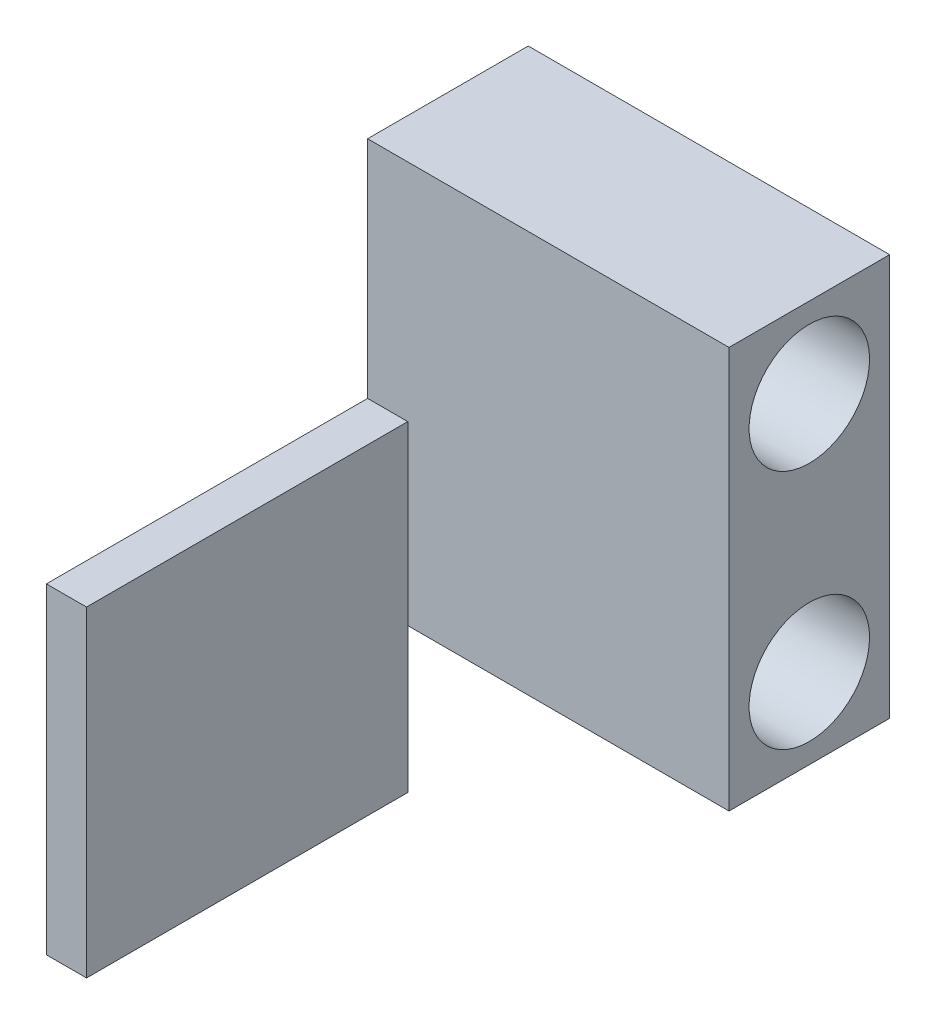
ISO-10303-21;
HEADER;
FILE_DESCRIPTION(('STEP AP214'),'2;1');
FILE_NAME('part.step','',(''),(''),'','','');
FILE_SCHEMA(('AUTOMOTIVE_DESIGN { 1 0 10303 214 1 1 1 1 }'));
ENDSEC;
DATA;
#1=APPLICATION_CONTEXT('core data for automotive mechanical design processes');
#2=APPLICATION_PROTOCOL_DEFINITION('international standard','automotive_design',2000,#1);
#3=PRODUCT_CONTEXT('',#1,'mechanical');
#4=PRODUCT('Part','Part','',(#3));
#5=PRODUCT_RELATED_PRODUCT_CATEGORY('part','',(#4));
#6=PRODUCT_DEFINITION_FORMATION('','',#4);
#7=PRODUCT_DEFINITION_CONTEXT('part definition',#1,'design');
#8=PRODUCT_DEFINITION('design','',#6,#7);
#9=PRODUCT_DEFINITION_SHAPE('','',#8);
#10=(LENGTH_UNIT() NAMED_UNIT(*) SI_UNIT(.MILLI.,.METRE.));
#11=(NAMED_UNIT(*) PLANE_ANGLE_UNIT() SI_UNIT($,.RADIAN.));
#12=(NAMED_UNIT(*) SI_UNIT($,.STERADIAN.) SOLID_ANGLE_UNIT());
#13=UNCERTAINTY_MEASURE_WITH_UNIT(LENGTH_MEASURE(1.E-05),#10,'distance_accuracy_value','');
#14=(GEOMETRIC_REPRESENTATION_CONTEXT(3) GLOBAL_UNCERTAINTY_ASSIGNED_CONTEXT((#13)) GLOBAL_UNIT_ASSIGNED_CONTEXT((#10,
#11,#12)) REPRESENTATION_CONTEXT('',''));
#15=CARTESIAN_POINT('',(0.,0.,0.));
#16=DIRECTION('',(0.,0.,1.));
#17=DIRECTION('',(1.,0.,0.));
#18=AXIS2_PLACEMENT_3D('',#15,#16,#17);
#19=CARTESIAN_POINT('',(22.5,25.,10.));
#20=DIRECTION('',(0.,0.,-1.));
#21=DIRECTION('',(-1.,0.,0.));
#22=AXIS2_PLACEMENT_3D('',#19,#20,#21);
#23=PLANE('',#22);
#24=DIRECTION('',(-1.,0.,0.));
#25=VECTOR('',#24,1.);
#26=CARTESIAN_POINT('',(-22.5,-3.00000000000002,10.));
#27=LINE('',#26,#25);
#28=CARTESIAN_POINT('',(-17.5,-3.00000000000002,10.));
#29=VERTEX_POINT('',#28);
#30=CARTESIAN_POINT('',(-22.5,-3.00000000000002,10.));
#31=VERTEX_POINT('',#30);
#32=EDGE_CURVE('E120',#29,#31,#27,.T.);
#33=ORIENTED_EDGE('',*,*,#32,.F.);
#34=DIRECTION('',(0.,1.,0.));
#35=VECTOR('',#34,1.);
#36=CARTESIAN_POINT('',(-17.5,-3.00000000000002,10.));
#37=LINE('',#36,#35);
#38=CARTESIAN_POINT('',(-17.5,-25.,10.));
#39=VERTEX_POINT('',#38);
#40=EDGE_CURVE('E11',#39,#29,#37,.T.);
#41=ORIENTED_EDGE('',*,*,#40,.F.);
#42=DIRECTION('',(-1.,0.,0.));
#43=VECTOR('',#42,1.);
#44=CARTESIAN_POINT('',(22.5,-25.,10.));
#45=LINE('',#44,#43);
#46=CARTESIAN_POINT('',(22.5,-25.,10.));
#47=VERTEX_POINT('',#46);
#48=EDGE_CURVE('E36',#47,#39,#45,.T.);
#49=ORIENTED_EDGE('',*,*,#48,.F.);
#50=DIRECTION('',(0.,-1.,0.));
#51=VECTOR('',#50,1.);
#52=CARTESIAN_POINT('',(22.5,25.,10.));
#53=LINE('',#52,#51);
#54=CARTESIAN_POINT('',(22.5,25.,10.));
#55=VERTEX_POINT('',#54);
#56=EDGE_CURVE('E134',#55,#47,#53,.T.);
#57=ORIENTED_EDGE('',*,*,#56,.F.);
#58=DIRECTION('',(-1.,0.,0.));
#59=VECTOR('',#58,1.);
#60=CARTESIAN_POINT('',(22.5,25.,10.));
#61=LINE('',#60,#59);
#62=CARTESIAN_POINT('',(-22.5,25.,10.));
#63=VERTEX_POINT('',#62);
#64=EDGE_CURVE('E143',#55,#63,#61,.T.);
#65=ORIENTED_EDGE('',*,*,#64,.T.);
#66=DIRECTION('',(0.,-1.,0.));
#67=VECTOR('',#66,1.);
#68=CARTESIAN_POINT('',(-22.5,25.,10.));
#69=LINE('',#68,#67);
#70=EDGE_CURVE('E53',#63,#31,#69,.T.);
#71=ORIENTED_EDGE('',*,*,#70,.T.);
#72=EDGE_LOOP('',(#33,#41,#49,#57,#65,#71));
#73=FACE_BOUND('',#72,.T.);
#74=ADVANCED_FACE('F33',(#73),#23,.F.);
#75=CARTESIAN_POINT('',(22.5,-25.,10.));
#76=DIRECTION('',(0.,1.,0.));
#77=DIRECTION('',(0.,0.,1.));
#78=AXIS2_PLACEMENT_3D('',#75,#76,#77);
#79=PLANE('',#78);
#80=DIRECTION('',(0.,0.,-1.));
#81=VECTOR('',#80,1.);
#82=CARTESIAN_POINT('',(-22.5,-25.,10.));
#83=LINE('',#82,#81);
#84=CARTESIAN_POINT('',(-22.5,-25.,10.));
#85=VERTEX_POINT('',#84);
#86=CARTESIAN_POINT('',(-22.5,-25.,-10.));
#87=VERTEX_POINT('',#86);
#88=EDGE_CURVE('E128',#85,#87,#83,.T.);
#89=ORIENTED_EDGE('',*,*,#88,.T.);
#90=DIRECTION('',(-1.,0.,0.));
#91=VECTOR('',#90,1.);
#92=CARTESIAN_POINT('',(22.5,-25.,-10.));
#93=LINE('',#92,#91);
#94=CARTESIAN_POINT('',(22.5,-25.,-10.));
#95=VERTEX_POINT('',#94);
#96=EDGE_CURVE('E152',#95,#87,#93,.T.);
#97=ORIENTED_EDGE('',*,*,#96,.F.);
#98=DIRECTION('',(0.,0.,-1.));
#99=VECTOR('',#98,1.);
#100=CARTESIAN_POINT('',(22.5,-25.,10.));
#101=LINE('',#100,#99);
#102=EDGE_CURVE('E137',#47,#95,#101,.T.);
#103=ORIENTED_EDGE('',*,*,#102,.F.);
#104=ORIENTED_EDGE('',*,*,#48,.T.);
#105=EDGE_CURVE('E154',#39,#85,#45,.T.);
#106=ORIENTED_EDGE('',*,*,#105,.T.);
#107=EDGE_LOOP('',(#89,#97,#103,#104,#106));
#108=FACE_BOUND('',#107,.T.);
#109=ADVANCED_FACE('F161',(#108),#79,.F.);
#110=CARTESIAN_POINT('',(22.5,25.,-10.));
#111=DIRECTION('',(0.,0.,1.));
#112=DIRECTION('',(1.,0.,0.));
#113=AXIS2_PLACEMENT_3D('',#110,#111,#112);
#114=PLANE('',#113);
#115=DIRECTION('',(0.,1.,0.));
#116=VECTOR('',#115,1.);
#117=CARTESIAN_POINT('',(-22.5,25.,-10.));
#118=LINE('',#117,#116);
#119=CARTESIAN_POINT('',(-22.5,25.,-10.));
#120=VERTEX_POINT('',#119);
#121=EDGE_CURVE('E146',#87,#120,#118,.T.);
#122=ORIENTED_EDGE('',*,*,#121,.T.);
#123=DIRECTION('',(-1.,0.,0.));
#124=VECTOR('',#123,1.);
#125=CARTESIAN_POINT('',(22.5,25.,-10.));
#126=LINE('',#125,#124);
#127=CARTESIAN_POINT('',(22.5,25.,-10.));
#128=VERTEX_POINT('',#127);
#129=EDGE_CURVE('E150',#128,#120,#126,.T.);
#130=ORIENTED_EDGE('',*,*,#129,.F.);
#131=DIRECTION('',(0.,1.,0.));
#132=VECTOR('',#131,1.);
#133=CARTESIAN_POINT('',(22.5,25.,-10.));
#134=LINE('',#133,#132);
#135=EDGE_CURVE('E140',#95,#128,#134,.T.);
#136=ORIENTED_EDGE('',*,*,#135,.F.);
#137=ORIENTED_EDGE('',*,*,#96,.T.);
#138=EDGE_LOOP('',(#122,#130,#136,#137));
#139=FACE_BOUND('',#138,.T.);
#140=ADVANCED_FACE('F216',(#139),#114,.F.);
#141=CARTESIAN_POINT('',(22.5,25.,10.));
#142=DIRECTION('',(0.,-1.,0.));
#143=DIRECTION('',(0.,0.,-1.));
#144=AXIS2_PLACEMENT_3D('',#141,#142,#143);
#145=PLANE('',#144);
#146=DIRECTION('',(0.,0.,1.));
#147=VECTOR('',#146,1.);
#148=CARTESIAN_POINT('',(-22.5,25.,10.));
#149=LINE('',#148,#147);
#150=EDGE_CURVE('E138',#120,#63,#149,.T.);
#151=ORIENTED_EDGE('',*,*,#150,.T.);
#152=ORIENTED_EDGE('',*,*,#64,.F.);
#153=DIRECTION('',(0.,0.,1.));
#154=VECTOR('',#153,1.);
#155=CARTESIAN_POINT('',(22.5,25.,10.));
#156=LINE('',#155,#154);
#157=EDGE_CURVE('E142',#128,#55,#156,.T.);
#158=ORIENTED_EDGE('',*,*,#157,.F.);
#159=ORIENTED_EDGE('',*,*,#129,.T.);
#160=EDGE_LOOP('',(#151,#152,#158,#159));
#161=FACE_BOUND('',#160,.T.);
#162=ADVANCED_FACE('F208',(#161),#145,.F.);
#163=CARTESIAN_POINT('',(22.5,0.,0.));
#164=DIRECTION('',(1.,0.,0.));
#165=DIRECTION('',(0.,0.,-1.));
#166=AXIS2_PLACEMENT_3D('',#163,#164,#165);
#167=PLANE('',#166);
#168=CARTESIAN_POINT('',(22.5,-15.,0.));
#169=DIRECTION('',(1.,0.,0.));
#170=DIRECTION('',(0.,0.,-1.));
#171=AXIS2_PLACEMENT_3D('',#168,#169,#170);
#172=CIRCLE('',#171,7.5);
#173=CARTESIAN_POINT('',(22.5,-15.,-7.5));
#174=VERTEX_POINT('',#173);
#175=EDGE_CURVE('E183',#174,#174,#172,.T.);
#176=ORIENTED_EDGE('',*,*,#175,.F.);
#177=EDGE_LOOP('',(#176));
#178=FACE_BOUND('',#177,.T.);
#179=CARTESIAN_POINT('',(22.5,15.,0.));
#180=DIRECTION('',(1.,0.,0.));
#181=DIRECTION('',(0.,0.,-1.));
#182=AXIS2_PLACEMENT_3D('',#179,#180,#181);
#183=CIRCLE('',#182,7.5);
#184=CARTESIAN_POINT('',(22.5,15.,-7.5));
#185=VERTEX_POINT('',#184);
#186=EDGE_CURVE('E191',#185,#185,#183,.T.);
#187=ORIENTED_EDGE('',*,*,#186,.F.);
#188=EDGE_LOOP('',(#187));
#189=FACE_BOUND('',#188,.T.);
#190=ORIENTED_EDGE('',*,*,#56,.T.);
#191=ORIENTED_EDGE('',*,*,#102,.T.);
#192=ORIENTED_EDGE('',*,*,#135,.T.);
#193=ORIENTED_EDGE('',*,*,#157,.T.);
#194=EDGE_LOOP('',(#190,#191,#192,#193));
#195=FACE_BOUND('',#194,.T.);
#196=ADVANCED_FACE('F205',(#178,#189,#195),#167,.T.);
#197=CARTESIAN_POINT('',(-22.5,0.,0.));
#198=DIRECTION('',(1.,0.,0.));
#199=DIRECTION('',(0.,0.,-1.));
#200=AXIS2_PLACEMENT_3D('',#197,#198,#199);
#201=PLANE('',#200);
#202=CARTESIAN_POINT('',(-22.5,-15.,0.));
#203=DIRECTION('',(1.,0.,0.));
#204=DIRECTION('',(0.,0.,-1.));
#205=AXIS2_PLACEMENT_3D('',#202,#203,#204);
#206=CIRCLE('',#205,7.5);
#207=CARTESIAN_POINT('',(-22.5,-15.,-7.5));
#208=VERTEX_POINT('',#207);
#209=EDGE_CURVE('E181',#208,#208,#206,.T.);
#210=ORIENTED_EDGE('',*,*,#209,.T.);
#211=EDGE_LOOP('',(#210));
#212=FACE_BOUND('',#211,.T.);
#213=CARTESIAN_POINT('',(-22.5,15.,0.));
#214=DIRECTION('',(1.,0.,0.));
#215=DIRECTION('',(0.,0.,-1.));
#216=AXIS2_PLACEMENT_3D('',#213,#214,#215);
#217=CIRCLE('',#216,7.5);
#218=CARTESIAN_POINT('',(-22.5,15.,-7.5));
#219=VERTEX_POINT('',#218);
#220=EDGE_CURVE('E188',#219,#219,#217,.T.);
#221=ORIENTED_EDGE('',*,*,#220,.T.);
#222=EDGE_LOOP('',(#221));
#223=FACE_BOUND('',#222,.T.);
#224=ORIENTED_EDGE('',*,*,#70,.F.);
#225=ORIENTED_EDGE('',*,*,#150,.F.);
#226=ORIENTED_EDGE('',*,*,#121,.F.);
#227=ORIENTED_EDGE('',*,*,#88,.F.);
#228=DIRECTION('',(0.,-1.,0.));
#229=VECTOR('',#228,1.);
#230=CARTESIAN_POINT('',(-22.5,-3.00000000000002,10.));
#231=LINE('',#230,#229);
#232=CARTESIAN_POINT('',(-22.5,-43.,10.));
#233=VERTEX_POINT('',#232);
#234=EDGE_CURVE('E125',#85,#233,#231,.T.);
#235=ORIENTED_EDGE('',*,*,#234,.T.);
#236=DIRECTION('',(0.,0.,-1.));
#237=VECTOR('',#236,1.);
#238=CARTESIAN_POINT('',(-22.5,-43.,50.));
#239=LINE('',#238,#237);
#240=CARTESIAN_POINT('',(-22.5,-43.,50.));
#241=VERTEX_POINT('',#240);
#242=EDGE_CURVE('E105',#241,#233,#239,.T.);
#243=ORIENTED_EDGE('',*,*,#242,.F.);
#244=DIRECTION('',(0.,-1.,0.));
#245=VECTOR('',#244,1.);
#246=CARTESIAN_POINT('',(-22.5,-3.00000000000002,50.));
#247=LINE('',#246,#245);
#248=CARTESIAN_POINT('',(-22.5,-3.00000000000002,50.));
#249=VERTEX_POINT('',#248);
#250=EDGE_CURVE('E111',#249,#241,#247,.T.);
#251=ORIENTED_EDGE('',*,*,#250,.F.);
#252=DIRECTION('',(0.,0.,-1.));
#253=VECTOR('',#252,1.);
#254=CARTESIAN_POINT('',(-22.5,-3.00000000000002,50.));
#255=LINE('',#254,#253);
#256=EDGE_CURVE('E176',#249,#31,#255,.T.);
#257=ORIENTED_EDGE('',*,*,#256,.T.);
#258=EDGE_LOOP('',(#224,#225,#226,#227,#235,#243,#251,#257));
#259=FACE_BOUND('',#258,.T.);
#260=ADVANCED_FACE('F122',(#212,#223,#259),#201,.F.);
#261=CARTESIAN_POINT('',(-22.5,-43.,50.));
#262=DIRECTION('',(0.,1.,0.));
#263=DIRECTION('',(0.,0.,1.));
#264=AXIS2_PLACEMENT_3D('',#261,#262,#263);
#265=PLANE('',#264);
#266=DIRECTION('',(1.,0.,0.));
#267=VECTOR('',#266,1.);
#268=CARTESIAN_POINT('',(-22.5,-43.,10.));
#269=LINE('',#268,#267);
#270=CARTESIAN_POINT('',(-17.5,-43.,10.));
#271=VERTEX_POINT('',#270);
#272=EDGE_CURVE('E171',#233,#271,#269,.T.);
#273=ORIENTED_EDGE('',*,*,#272,.T.);
#274=DIRECTION('',(0.,0.,-1.));
#275=VECTOR('',#274,1.);
#276=CARTESIAN_POINT('',(-17.5,-43.,50.));
#277=LINE('',#276,#275);
#278=CARTESIAN_POINT('',(-17.5,-43.,50.));
#279=VERTEX_POINT('',#278);
#280=EDGE_CURVE('E107',#279,#271,#277,.T.);
#281=ORIENTED_EDGE('',*,*,#280,.F.);
#282=DIRECTION('',(1.,0.,0.));
#283=VECTOR('',#282,1.);
#284=CARTESIAN_POINT('',(-22.5,-43.,50.));
#285=LINE('',#284,#283);
#286=EDGE_CURVE('E101',#241,#279,#285,.T.);
#287=ORIENTED_EDGE('',*,*,#286,.F.);
#288=ORIENTED_EDGE('',*,*,#242,.T.);
#289=EDGE_LOOP('',(#273,#281,#287,#288));
#290=FACE_BOUND('',#289,.T.);
#291=ADVANCED_FACE('F103',(#290),#265,.F.);
#292=CARTESIAN_POINT('',(-17.5,-3.00000000000002,50.));
#293=DIRECTION('',(-1.,0.,0.));
#294=DIRECTION('',(0.,-1.,0.));
#295=AXIS2_PLACEMENT_3D('',#292,#293,#294);
#296=PLANE('',#295);
#297=EDGE_CURVE('E42',#271,#39,#37,.T.);
#298=ORIENTED_EDGE('',*,*,#297,.T.);
#299=ORIENTED_EDGE('',*,*,#40,.T.);
#300=DIRECTION('',(0.,0.,-1.));
#301=VECTOR('',#300,1.);
#302=CARTESIAN_POINT('',(-17.5,-3.00000000000002,50.));
#303=LINE('',#302,#301);
#304=CARTESIAN_POINT('',(-17.5,-3.00000000000002,50.));
#305=VERTEX_POINT('',#304);
#306=EDGE_CURVE('E130',#305,#29,#303,.T.);
#307=ORIENTED_EDGE('',*,*,#306,.F.);
#308=DIRECTION('',(0.,1.,0.));
#309=VECTOR('',#308,1.);
#310=CARTESIAN_POINT('',(-17.5,-3.00000000000002,50.));
#311=LINE('',#310,#309);
#312=EDGE_CURVE('E110',#279,#305,#311,.T.);
#313=ORIENTED_EDGE('',*,*,#312,.F.);
#314=ORIENTED_EDGE('',*,*,#280,.T.);
#315=EDGE_LOOP('',(#298,#299,#307,#313,#314));
#316=FACE_BOUND('',#315,.T.);
#317=ADVANCED_FACE('F168',(#316),#296,.F.);
#318=CARTESIAN_POINT('',(-22.5,-3.00000000000002,50.));
#319=DIRECTION('',(0.,-1.,0.));
#320=DIRECTION('',(1.,0.,0.));
#321=AXIS2_PLACEMENT_3D('',#318,#319,#320);
#322=PLANE('',#321);
#323=ORIENTED_EDGE('',*,*,#32,.T.);
#324=ORIENTED_EDGE('',*,*,#256,.F.);
#325=DIRECTION('',(-1.,0.,0.));
#326=VECTOR('',#325,1.);
#327=CARTESIAN_POINT('',(-22.5,-3.00000000000002,50.));
#328=LINE('',#327,#326);
#329=EDGE_CURVE('E116',#305,#249,#328,.T.);
#330=ORIENTED_EDGE('',*,*,#329,.F.);
#331=ORIENTED_EDGE('',*,*,#306,.T.);
#332=EDGE_LOOP('',(#323,#324,#330,#331));
#333=FACE_BOUND('',#332,.T.);
#334=ADVANCED_FACE('F178',(#333),#322,.F.);
#335=CARTESIAN_POINT('',(0.,0.,50.));
#336=DIRECTION('',(0.,0.,1.));
#337=DIRECTION('',(1.,0.,0.));
#338=AXIS2_PLACEMENT_3D('',#335,#336,#337);
#339=PLANE('',#338);
#340=ORIENTED_EDGE('',*,*,#250,.T.);
#341=ORIENTED_EDGE('',*,*,#286,.T.);
#342=ORIENTED_EDGE('',*,*,#312,.T.);
#343=ORIENTED_EDGE('',*,*,#329,.T.);
#344=EDGE_LOOP('',(#340,#341,#342,#343));
#345=FACE_BOUND('',#344,.T.);
#346=ADVANCED_FACE('F114',(#345),#339,.T.);
#347=CARTESIAN_POINT('',(0.,0.,10.));
#348=DIRECTION('',(0.,0.,1.));
#349=DIRECTION('',(1.,0.,0.));
#350=AXIS2_PLACEMENT_3D('',#347,#348,#349);
#351=PLANE('',#350);
#352=ORIENTED_EDGE('',*,*,#105,.F.);
#353=ORIENTED_EDGE('',*,*,#297,.F.);
#354=ORIENTED_EDGE('',*,*,#272,.F.);
#355=ORIENTED_EDGE('',*,*,#234,.F.);
#356=EDGE_LOOP('',(#352,#353,#354,#355));
#357=FACE_BOUND('',#356,.T.);
#358=ADVANCED_FACE('F166',(#357),#351,.F.);
#359=CARTESIAN_POINT('',(-22.5,15.,0.));
#360=DIRECTION('',(1.,0.,0.));
#361=DIRECTION('',(0.,0.,-1.));
#362=AXIS2_PLACEMENT_3D('',#359,#360,#361);
#363=CYLINDRICAL_SURFACE('',#362,7.5);
#364=ORIENTED_EDGE('',*,*,#220,.F.);
#365=EDGE_LOOP('',(#364));
#366=FACE_BOUND('',#365,.T.);
#367=ORIENTED_EDGE('',*,*,#186,.T.);
#368=EDGE_LOOP('',(#367));
#369=FACE_BOUND('',#368,.T.);
#370=ADVANCED_FACE('F198',(#366,#369),#363,.F.);
#371=CARTESIAN_POINT('',(-22.5,-15.,0.));
#372=DIRECTION('',(1.,0.,0.));
#373=DIRECTION('',(0.,0.,-1.));
#374=AXIS2_PLACEMENT_3D('',#371,#372,#373);
#375=CYLINDRICAL_SURFACE('',#374,7.5);
#376=ORIENTED_EDGE('',*,*,#209,.F.);
#377=EDGE_LOOP('',(#376));
#378=FACE_BOUND('',#377,.T.);
#379=ORIENTED_EDGE('',*,*,#175,.T.);
#380=EDGE_LOOP('',(#379));
#381=FACE_BOUND('',#380,.T.);
#382=ADVANCED_FACE('F201',(#378,#381),#375,.F.);
#383=CLOSED_SHELL('',(#74,#109,#140,#162,#196,#260,#291,#317,#334,#346,#358,#370,#382));
#384=MANIFOLD_SOLID_BREP('B2',#383);
#385=ADVANCED_BREP_SHAPE_REPRESENTATION('',(#18,#384),#14);
#386=SHAPE_DEFINITION_REPRESENTATION(#9,#385);
ENDSEC;
END-ISO-10303-21;
